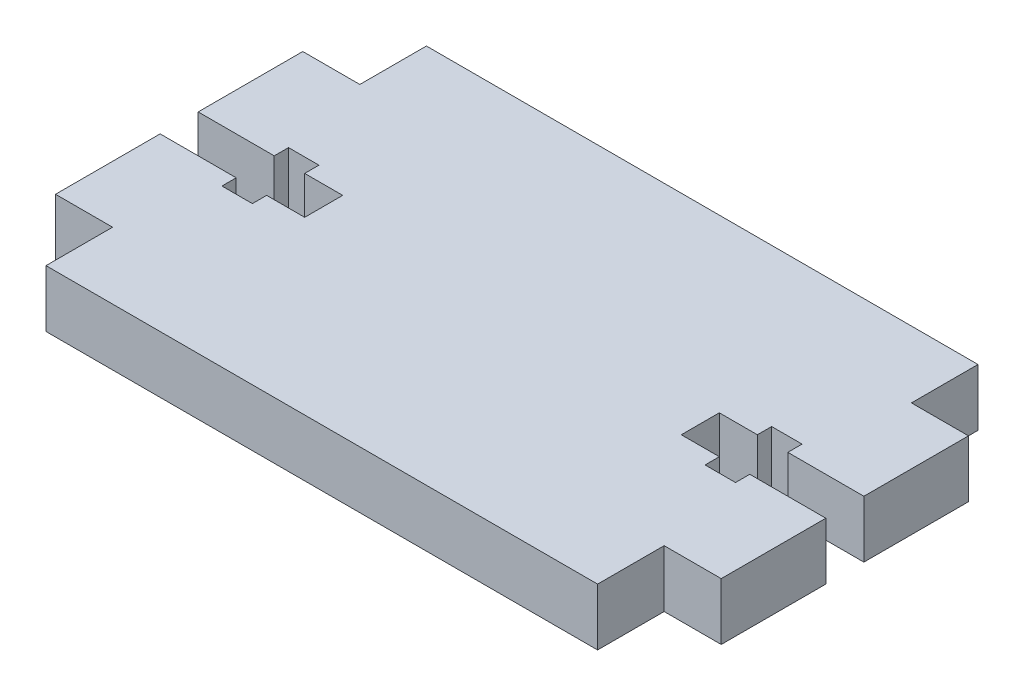
ISO-10303-21;
HEADER;
FILE_DESCRIPTION(('STEP AP214'),'2;1');
FILE_NAME('part.step','',(''),(''),'','','');
FILE_SCHEMA(('AUTOMOTIVE_DESIGN { 1 0 10303 214 1 1 1 1 }'));
ENDSEC;
DATA;
#1=APPLICATION_CONTEXT('core data for automotive mechanical design processes');
#2=APPLICATION_PROTOCOL_DEFINITION('international standard','automotive_design',2000,#1);
#3=PRODUCT_CONTEXT('',#1,'mechanical');
#4=PRODUCT('Part','Part','',(#3));
#5=PRODUCT_RELATED_PRODUCT_CATEGORY('part','',(#4));
#6=PRODUCT_DEFINITION_FORMATION('','',#4);
#7=PRODUCT_DEFINITION_CONTEXT('part definition',#1,'design');
#8=PRODUCT_DEFINITION('design','',#6,#7);
#9=PRODUCT_DEFINITION_SHAPE('','',#8);
#10=(LENGTH_UNIT() NAMED_UNIT(*) SI_UNIT(.MILLI.,.METRE.));
#11=(NAMED_UNIT(*) PLANE_ANGLE_UNIT() SI_UNIT($,.RADIAN.));
#12=(NAMED_UNIT(*) SI_UNIT($,.STERADIAN.) SOLID_ANGLE_UNIT());
#13=UNCERTAINTY_MEASURE_WITH_UNIT(LENGTH_MEASURE(1.E-05),#10,'distance_accuracy_value','');
#14=(GEOMETRIC_REPRESENTATION_CONTEXT(3) GLOBAL_UNCERTAINTY_ASSIGNED_CONTEXT((#13)) GLOBAL_UNIT_ASSIGNED_CONTEXT((#10,
#11,#12)) REPRESENTATION_CONTEXT('',''));
#15=CARTESIAN_POINT('',(0.,0.,0.));
#16=DIRECTION('',(0.,0.,1.));
#17=DIRECTION('',(1.,0.,0.));
#18=AXIS2_PLACEMENT_3D('',#15,#16,#17);
#19=CARTESIAN_POINT('',(29.,6.,13.));
#20=DIRECTION('',(-1.,0.,0.));
#21=DIRECTION('',(0.,0.,1.));
#22=AXIS2_PLACEMENT_3D('',#19,#20,#21);
#23=PLANE('',#22);
#24=DIRECTION('',(0.,0.,-1.));
#25=VECTOR('',#24,1.);
#26=CARTESIAN_POINT('',(29.,0.,13.));
#27=LINE('',#26,#25);
#28=CARTESIAN_POINT('',(29.,0.,20.));
#29=VERTEX_POINT('',#28);
#30=CARTESIAN_POINT('',(29.,0.,13.));
#31=VERTEX_POINT('',#30);
#32=EDGE_CURVE('E305',#29,#31,#27,.T.);
#33=ORIENTED_EDGE('',*,*,#32,.T.);
#34=DIRECTION('',(0.,-1.,0.));
#35=VECTOR('',#34,1.);
#36=CARTESIAN_POINT('',(29.,6.,13.));
#37=LINE('',#36,#35);
#38=CARTESIAN_POINT('',(29.,6.,13.));
#39=VERTEX_POINT('',#38);
#40=EDGE_CURVE('E11',#39,#31,#37,.T.);
#41=ORIENTED_EDGE('',*,*,#40,.F.);
#42=DIRECTION('',(0.,0.,-1.));
#43=VECTOR('',#42,1.);
#44=CARTESIAN_POINT('',(29.,6.,13.));
#45=LINE('',#44,#43);
#46=CARTESIAN_POINT('',(29.,6.,20.));
#47=VERTEX_POINT('',#46);
#48=EDGE_CURVE('E375',#47,#39,#45,.T.);
#49=ORIENTED_EDGE('',*,*,#48,.F.);
#50=DIRECTION('',(0.,-1.,0.));
#51=VECTOR('',#50,1.);
#52=CARTESIAN_POINT('',(29.,6.,20.));
#53=LINE('',#52,#51);
#54=EDGE_CURVE('E301',#47,#29,#53,.T.);
#55=ORIENTED_EDGE('',*,*,#54,.T.);
#56=EDGE_LOOP('',(#33,#41,#49,#55));
#57=FACE_BOUND('',#56,.T.);
#58=ADVANCED_FACE('F41',(#57),#23,.F.);
#59=CARTESIAN_POINT('',(29.,6.,13.));
#60=DIRECTION('',(0.,0.,-1.));
#61=DIRECTION('',(-1.,0.,0.));
#62=AXIS2_PLACEMENT_3D('',#59,#60,#61);
#63=PLANE('',#62);
#64=DIRECTION('',(1.,0.,0.));
#65=VECTOR('',#64,1.);
#66=CARTESIAN_POINT('',(29.,0.,13.));
#67=LINE('',#66,#65);
#68=CARTESIAN_POINT('',(35.,0.,13.));
#69=VERTEX_POINT('',#68);
#70=EDGE_CURVE('E308',#31,#69,#67,.T.);
#71=ORIENTED_EDGE('',*,*,#70,.T.);
#72=DIRECTION('',(0.,-1.,0.));
#73=VECTOR('',#72,1.);
#74=CARTESIAN_POINT('',(35.,6.,13.));
#75=LINE('',#74,#73);
#76=CARTESIAN_POINT('',(35.,6.,13.));
#77=VERTEX_POINT('',#76);
#78=EDGE_CURVE('E49',#77,#69,#75,.T.);
#79=ORIENTED_EDGE('',*,*,#78,.F.);
#80=DIRECTION('',(1.,0.,0.));
#81=VECTOR('',#80,1.);
#82=CARTESIAN_POINT('',(29.,6.,13.));
#83=LINE('',#82,#81);
#84=EDGE_CURVE('E184',#39,#77,#83,.T.);
#85=ORIENTED_EDGE('',*,*,#84,.F.);
#86=ORIENTED_EDGE('',*,*,#40,.T.);
#87=EDGE_LOOP('',(#71,#79,#85,#86));
#88=FACE_BOUND('',#87,.T.);
#89=ADVANCED_FACE('F573',(#88),#63,.F.);
#90=CARTESIAN_POINT('',(35.,6.,13.));
#91=DIRECTION('',(-1.,0.,0.));
#92=DIRECTION('',(0.,0.,1.));
#93=AXIS2_PLACEMENT_3D('',#90,#91,#92);
#94=PLANE('',#93);
#95=DIRECTION('',(0.,0.,-1.));
#96=VECTOR('',#95,1.);
#97=CARTESIAN_POINT('',(35.,0.,13.));
#98=LINE('',#97,#96);
#99=CARTESIAN_POINT('',(35.,0.,2.));
#100=VERTEX_POINT('',#99);
#101=EDGE_CURVE('E310',#69,#100,#98,.T.);
#102=ORIENTED_EDGE('',*,*,#101,.T.);
#103=DIRECTION('',(0.,-1.,0.));
#104=VECTOR('',#103,1.);
#105=CARTESIAN_POINT('',(35.,6.,2.));
#106=LINE('',#105,#104);
#107=CARTESIAN_POINT('',(35.,6.,2.));
#108=VERTEX_POINT('',#107);
#109=EDGE_CURVE('E466',#108,#100,#106,.T.);
#110=ORIENTED_EDGE('',*,*,#109,.F.);
#111=DIRECTION('',(0.,0.,-1.));
#112=VECTOR('',#111,1.);
#113=CARTESIAN_POINT('',(35.,6.,13.));
#114=LINE('',#113,#112);
#115=EDGE_CURVE('E474',#77,#108,#114,.T.);
#116=ORIENTED_EDGE('',*,*,#115,.F.);
#117=ORIENTED_EDGE('',*,*,#78,.T.);
#118=EDGE_LOOP('',(#102,#110,#116,#117));
#119=FACE_BOUND('',#118,.T.);
#120=ADVANCED_FACE('F472',(#119),#94,.F.);
#121=CARTESIAN_POINT('',(26.9999999999999,6.,2.));
#122=DIRECTION('',(0.,0.,1.));
#123=DIRECTION('',(1.,0.,0.));
#124=AXIS2_PLACEMENT_3D('',#121,#122,#123);
#125=PLANE('',#124);
#126=DIRECTION('',(-1.,0.,0.));
#127=VECTOR('',#126,1.);
#128=CARTESIAN_POINT('',(26.9999999999999,0.,2.));
#129=LINE('',#128,#127);
#130=CARTESIAN_POINT('',(26.9999999999999,0.,2.));
#131=VERTEX_POINT('',#130);
#132=EDGE_CURVE('E312',#100,#131,#129,.T.);
#133=ORIENTED_EDGE('',*,*,#132,.T.);
#134=DIRECTION('',(0.,-1.,0.));
#135=VECTOR('',#134,1.);
#136=CARTESIAN_POINT('',(26.9999999999999,6.,2.));
#137=LINE('',#136,#135);
#138=CARTESIAN_POINT('',(26.9999999999999,6.,2.));
#139=VERTEX_POINT('',#138);
#140=EDGE_CURVE('E463',#139,#131,#137,.T.);
#141=ORIENTED_EDGE('',*,*,#140,.F.);
#142=DIRECTION('',(-1.,0.,0.));
#143=VECTOR('',#142,1.);
#144=CARTESIAN_POINT('',(26.9999999999999,6.,2.));
#145=LINE('',#144,#143);
#146=EDGE_CURVE('E492',#108,#139,#145,.T.);
#147=ORIENTED_EDGE('',*,*,#146,.F.);
#148=ORIENTED_EDGE('',*,*,#109,.T.);
#149=EDGE_LOOP('',(#133,#141,#147,#148));
#150=FACE_BOUND('',#149,.T.);
#151=ADVANCED_FACE('F483',(#150),#125,.F.);
#152=CARTESIAN_POINT('',(26.9999999999999,6.,3.5));
#153=DIRECTION('',(1.,0.,0.));
#154=DIRECTION('',(0.,0.,-1.));
#155=AXIS2_PLACEMENT_3D('',#152,#153,#154);
#156=PLANE('',#155);
#157=DIRECTION('',(0.,0.,1.));
#158=VECTOR('',#157,1.);
#159=CARTESIAN_POINT('',(26.9999999999999,0.,3.5));
#160=LINE('',#159,#158);
#161=CARTESIAN_POINT('',(26.9999999999999,0.,3.5));
#162=VERTEX_POINT('',#161);
#163=EDGE_CURVE('E314',#131,#162,#160,.T.);
#164=ORIENTED_EDGE('',*,*,#163,.T.);
#165=DIRECTION('',(0.,-1.,0.));
#166=VECTOR('',#165,1.);
#167=CARTESIAN_POINT('',(26.9999999999999,6.,3.5));
#168=LINE('',#167,#166);
#169=CARTESIAN_POINT('',(26.9999999999999,6.,3.5));
#170=VERTEX_POINT('',#169);
#171=EDGE_CURVE('E460',#170,#162,#168,.T.);
#172=ORIENTED_EDGE('',*,*,#171,.F.);
#173=DIRECTION('',(0.,0.,1.));
#174=VECTOR('',#173,1.);
#175=CARTESIAN_POINT('',(26.9999999999999,6.,3.5));
#176=LINE('',#175,#174);
#177=EDGE_CURVE('E489',#139,#170,#176,.T.);
#178=ORIENTED_EDGE('',*,*,#177,.F.);
#179=ORIENTED_EDGE('',*,*,#140,.T.);
#180=EDGE_LOOP('',(#164,#172,#178,#179));
#181=FACE_BOUND('',#180,.T.);
#182=ADVANCED_FACE('F487',(#181),#156,.F.);
#183=CARTESIAN_POINT('',(23.7999999999999,6.,3.5));
#184=DIRECTION('',(0.,0.,1.));
#185=DIRECTION('',(1.,0.,0.));
#186=AXIS2_PLACEMENT_3D('',#183,#184,#185);
#187=PLANE('',#186);
#188=DIRECTION('',(-1.,0.,0.));
#189=VECTOR('',#188,1.);
#190=CARTESIAN_POINT('',(23.7999999999999,0.,3.5));
#191=LINE('',#190,#189);
#192=CARTESIAN_POINT('',(23.7999999999999,0.,3.5));
#193=VERTEX_POINT('',#192);
#194=EDGE_CURVE('E316',#162,#193,#191,.T.);
#195=ORIENTED_EDGE('',*,*,#194,.T.);
#196=DIRECTION('',(0.,-1.,0.));
#197=VECTOR('',#196,1.);
#198=CARTESIAN_POINT('',(23.7999999999999,6.,3.5));
#199=LINE('',#198,#197);
#200=CARTESIAN_POINT('',(23.7999999999999,6.,3.5));
#201=VERTEX_POINT('',#200);
#202=EDGE_CURVE('E457',#201,#193,#199,.T.);
#203=ORIENTED_EDGE('',*,*,#202,.F.);
#204=DIRECTION('',(-1.,0.,0.));
#205=VECTOR('',#204,1.);
#206=CARTESIAN_POINT('',(23.7999999999999,6.,3.5));
#207=LINE('',#206,#205);
#208=EDGE_CURVE('E491',#170,#201,#207,.T.);
#209=ORIENTED_EDGE('',*,*,#208,.F.);
#210=ORIENTED_EDGE('',*,*,#171,.T.);
#211=EDGE_LOOP('',(#195,#203,#209,#210));
#212=FACE_BOUND('',#211,.T.);
#213=ADVANCED_FACE('F586',(#212),#187,.F.);
#214=CARTESIAN_POINT('',(23.7999999999999,6.,2.));
#215=DIRECTION('',(-1.,0.,0.));
#216=DIRECTION('',(0.,0.,1.));
#217=AXIS2_PLACEMENT_3D('',#214,#215,#216);
#218=PLANE('',#217);
#219=DIRECTION('',(0.,0.,-1.));
#220=VECTOR('',#219,1.);
#221=CARTESIAN_POINT('',(23.7999999999999,0.,2.));
#222=LINE('',#221,#220);
#223=CARTESIAN_POINT('',(23.7999999999999,0.,2.));
#224=VERTEX_POINT('',#223);
#225=EDGE_CURVE('E318',#193,#224,#222,.T.);
#226=ORIENTED_EDGE('',*,*,#225,.T.);
#227=DIRECTION('',(0.,-1.,0.));
#228=VECTOR('',#227,1.);
#229=CARTESIAN_POINT('',(23.7999999999999,6.,2.));
#230=LINE('',#229,#228);
#231=CARTESIAN_POINT('',(23.7999999999999,6.,2.));
#232=VERTEX_POINT('',#231);
#233=EDGE_CURVE('E454',#232,#224,#230,.T.);
#234=ORIENTED_EDGE('',*,*,#233,.F.);
#235=DIRECTION('',(0.,0.,-1.));
#236=VECTOR('',#235,1.);
#237=CARTESIAN_POINT('',(23.7999999999999,6.,2.));
#238=LINE('',#237,#236);
#239=EDGE_CURVE('E494',#201,#232,#238,.T.);
#240=ORIENTED_EDGE('',*,*,#239,.F.);
#241=ORIENTED_EDGE('',*,*,#202,.T.);
#242=EDGE_LOOP('',(#226,#234,#240,#241));
#243=FACE_BOUND('',#242,.T.);
#244=ADVANCED_FACE('F589',(#243),#218,.F.);
#245=CARTESIAN_POINT('',(19.7999999999999,6.,2.00000000000001));
#246=DIRECTION('',(0.,0.,1.));
#247=DIRECTION('',(1.,0.,0.));
#248=AXIS2_PLACEMENT_3D('',#245,#246,#247);
#249=PLANE('',#248);
#250=DIRECTION('',(-1.,0.,0.));
#251=VECTOR('',#250,1.);
#252=CARTESIAN_POINT('',(19.7999999999999,0.,2.00000000000001));
#253=LINE('',#252,#251);
#254=CARTESIAN_POINT('',(19.7999999999999,0.,2.00000000000001));
#255=VERTEX_POINT('',#254);
#256=EDGE_CURVE('E320',#224,#255,#253,.T.);
#257=ORIENTED_EDGE('',*,*,#256,.T.);
#258=DIRECTION('',(0.,-1.,0.));
#259=VECTOR('',#258,1.);
#260=CARTESIAN_POINT('',(19.7999999999999,6.,2.00000000000001));
#261=LINE('',#260,#259);
#262=CARTESIAN_POINT('',(19.7999999999999,6.,2.00000000000001));
#263=VERTEX_POINT('',#262);
#264=EDGE_CURVE('E451',#263,#255,#261,.T.);
#265=ORIENTED_EDGE('',*,*,#264,.F.);
#266=DIRECTION('',(-1.,0.,0.));
#267=VECTOR('',#266,1.);
#268=CARTESIAN_POINT('',(19.7999999999999,6.,2.00000000000001));
#269=LINE('',#268,#267);
#270=EDGE_CURVE('E500',#232,#263,#269,.T.);
#271=ORIENTED_EDGE('',*,*,#270,.F.);
#272=ORIENTED_EDGE('',*,*,#233,.T.);
#273=EDGE_LOOP('',(#257,#265,#271,#272));
#274=FACE_BOUND('',#273,.T.);
#275=ADVANCED_FACE('F593',(#274),#249,.F.);
#276=CARTESIAN_POINT('',(19.7999999999999,6.,-1.99999999999999));
#277=DIRECTION('',(-1.,0.,0.));
#278=DIRECTION('',(0.,0.,1.));
#279=AXIS2_PLACEMENT_3D('',#276,#277,#278);
#280=PLANE('',#279);
#281=DIRECTION('',(0.,0.,-1.));
#282=VECTOR('',#281,1.);
#283=CARTESIAN_POINT('',(19.7999999999999,0.,-1.99999999999999));
#284=LINE('',#283,#282);
#285=CARTESIAN_POINT('',(19.7999999999999,0.,-1.99999999999999));
#286=VERTEX_POINT('',#285);
#287=EDGE_CURVE('E322',#255,#286,#284,.T.);
#288=ORIENTED_EDGE('',*,*,#287,.T.);
#289=DIRECTION('',(0.,-1.,0.));
#290=VECTOR('',#289,1.);
#291=CARTESIAN_POINT('',(19.7999999999999,6.,-1.99999999999999));
#292=LINE('',#291,#290);
#293=CARTESIAN_POINT('',(19.7999999999999,6.,-1.99999999999999));
#294=VERTEX_POINT('',#293);
#295=EDGE_CURVE('E448',#294,#286,#292,.T.);
#296=ORIENTED_EDGE('',*,*,#295,.F.);
#297=DIRECTION('',(0.,0.,-1.));
#298=VECTOR('',#297,1.);
#299=CARTESIAN_POINT('',(19.7999999999999,6.,-1.99999999999999));
#300=LINE('',#299,#298);
#301=EDGE_CURVE('E502',#263,#294,#300,.T.);
#302=ORIENTED_EDGE('',*,*,#301,.F.);
#303=ORIENTED_EDGE('',*,*,#264,.T.);
#304=EDGE_LOOP('',(#288,#296,#302,#303));
#305=FACE_BOUND('',#304,.T.);
#306=ADVANCED_FACE('F597',(#305),#280,.F.);
#307=CARTESIAN_POINT('',(23.7999999999999,6.,-2.));
#308=DIRECTION('',(0.,0.,-1.));
#309=DIRECTION('',(-1.,0.,0.));
#310=AXIS2_PLACEMENT_3D('',#307,#308,#309);
#311=PLANE('',#310);
#312=DIRECTION('',(1.,0.,0.));
#313=VECTOR('',#312,1.);
#314=CARTESIAN_POINT('',(23.7999999999999,0.,-2.));
#315=LINE('',#314,#313);
#316=CARTESIAN_POINT('',(23.7999999999999,0.,-2.));
#317=VERTEX_POINT('',#316);
#318=EDGE_CURVE('E324',#286,#317,#315,.T.);
#319=ORIENTED_EDGE('',*,*,#318,.T.);
#320=DIRECTION('',(0.,-1.,0.));
#321=VECTOR('',#320,1.);
#322=CARTESIAN_POINT('',(23.7999999999999,6.,-2.));
#323=LINE('',#322,#321);
#324=CARTESIAN_POINT('',(23.7999999999999,6.,-2.));
#325=VERTEX_POINT('',#324);
#326=EDGE_CURVE('E445',#325,#317,#323,.T.);
#327=ORIENTED_EDGE('',*,*,#326,.F.);
#328=DIRECTION('',(1.,0.,0.));
#329=VECTOR('',#328,1.);
#330=CARTESIAN_POINT('',(23.7999999999999,6.,-2.));
#331=LINE('',#330,#329);
#332=EDGE_CURVE('E504',#294,#325,#331,.T.);
#333=ORIENTED_EDGE('',*,*,#332,.F.);
#334=ORIENTED_EDGE('',*,*,#295,.T.);
#335=EDGE_LOOP('',(#319,#327,#333,#334));
#336=FACE_BOUND('',#335,.T.);
#337=ADVANCED_FACE('F601',(#336),#311,.F.);
#338=CARTESIAN_POINT('',(23.7999999999999,6.,-3.5));
#339=DIRECTION('',(-1.,0.,0.));
#340=DIRECTION('',(0.,0.,1.));
#341=AXIS2_PLACEMENT_3D('',#338,#339,#340);
#342=PLANE('',#341);
#343=DIRECTION('',(0.,0.,-1.));
#344=VECTOR('',#343,1.);
#345=CARTESIAN_POINT('',(23.7999999999999,0.,-3.5));
#346=LINE('',#345,#344);
#347=CARTESIAN_POINT('',(23.7999999999999,0.,-3.5));
#348=VERTEX_POINT('',#347);
#349=EDGE_CURVE('E326',#317,#348,#346,.T.);
#350=ORIENTED_EDGE('',*,*,#349,.T.);
#351=DIRECTION('',(0.,-1.,0.));
#352=VECTOR('',#351,1.);
#353=CARTESIAN_POINT('',(23.7999999999999,6.,-3.5));
#354=LINE('',#353,#352);
#355=CARTESIAN_POINT('',(23.7999999999999,6.,-3.5));
#356=VERTEX_POINT('',#355);
#357=EDGE_CURVE('E442',#356,#348,#354,.T.);
#358=ORIENTED_EDGE('',*,*,#357,.F.);
#359=DIRECTION('',(0.,0.,-1.));
#360=VECTOR('',#359,1.);
#361=CARTESIAN_POINT('',(23.7999999999999,6.,-3.5));
#362=LINE('',#361,#360);
#363=EDGE_CURVE('E506',#325,#356,#362,.T.);
#364=ORIENTED_EDGE('',*,*,#363,.F.);
#365=ORIENTED_EDGE('',*,*,#326,.T.);
#366=EDGE_LOOP('',(#350,#358,#364,#365));
#367=FACE_BOUND('',#366,.T.);
#368=ADVANCED_FACE('F605',(#367),#342,.F.);
#369=CARTESIAN_POINT('',(26.9999999999999,6.,-3.5));
#370=DIRECTION('',(0.,0.,-1.));
#371=DIRECTION('',(-1.,0.,0.));
#372=AXIS2_PLACEMENT_3D('',#369,#370,#371);
#373=PLANE('',#372);
#374=DIRECTION('',(1.,0.,0.));
#375=VECTOR('',#374,1.);
#376=CARTESIAN_POINT('',(26.9999999999999,0.,-3.5));
#377=LINE('',#376,#375);
#378=CARTESIAN_POINT('',(26.9999999999999,0.,-3.5));
#379=VERTEX_POINT('',#378);
#380=EDGE_CURVE('E328',#348,#379,#377,.T.);
#381=ORIENTED_EDGE('',*,*,#380,.T.);
#382=DIRECTION('',(0.,-1.,0.));
#383=VECTOR('',#382,1.);
#384=CARTESIAN_POINT('',(26.9999999999999,6.,-3.5));
#385=LINE('',#384,#383);
#386=CARTESIAN_POINT('',(26.9999999999999,6.,-3.5));
#387=VERTEX_POINT('',#386);
#388=EDGE_CURVE('E439',#387,#379,#385,.T.);
#389=ORIENTED_EDGE('',*,*,#388,.F.);
#390=DIRECTION('',(1.,0.,0.));
#391=VECTOR('',#390,1.);
#392=CARTESIAN_POINT('',(26.9999999999999,6.,-3.5));
#393=LINE('',#392,#391);
#394=EDGE_CURVE('E508',#356,#387,#393,.T.);
#395=ORIENTED_EDGE('',*,*,#394,.F.);
#396=ORIENTED_EDGE('',*,*,#357,.T.);
#397=EDGE_LOOP('',(#381,#389,#395,#396));
#398=FACE_BOUND('',#397,.T.);
#399=ADVANCED_FACE('F609',(#398),#373,.F.);
#400=CARTESIAN_POINT('',(26.9999999999999,6.,-2.));
#401=DIRECTION('',(1.,0.,0.));
#402=DIRECTION('',(0.,0.,-1.));
#403=AXIS2_PLACEMENT_3D('',#400,#401,#402);
#404=PLANE('',#403);
#405=DIRECTION('',(0.,0.,1.));
#406=VECTOR('',#405,1.);
#407=CARTESIAN_POINT('',(26.9999999999999,0.,-2.));
#408=LINE('',#407,#406);
#409=CARTESIAN_POINT('',(26.9999999999999,0.,-2.));
#410=VERTEX_POINT('',#409);
#411=EDGE_CURVE('E330',#379,#410,#408,.T.);
#412=ORIENTED_EDGE('',*,*,#411,.T.);
#413=DIRECTION('',(0.,-1.,0.));
#414=VECTOR('',#413,1.);
#415=CARTESIAN_POINT('',(26.9999999999999,6.,-2.));
#416=LINE('',#415,#414);
#417=CARTESIAN_POINT('',(26.9999999999999,6.,-2.));
#418=VERTEX_POINT('',#417);
#419=EDGE_CURVE('E436',#418,#410,#416,.T.);
#420=ORIENTED_EDGE('',*,*,#419,.F.);
#421=DIRECTION('',(0.,0.,1.));
#422=VECTOR('',#421,1.);
#423=CARTESIAN_POINT('',(26.9999999999999,6.,-2.));
#424=LINE('',#423,#422);
#425=EDGE_CURVE('E510',#387,#418,#424,.T.);
#426=ORIENTED_EDGE('',*,*,#425,.F.);
#427=ORIENTED_EDGE('',*,*,#388,.T.);
#428=EDGE_LOOP('',(#412,#420,#426,#427));
#429=FACE_BOUND('',#428,.T.);
#430=ADVANCED_FACE('F613',(#429),#404,.F.);
#431=CARTESIAN_POINT('',(34.9999999999999,6.,-1.99999999999999));
#432=DIRECTION('',(0.,0.,-1.));
#433=DIRECTION('',(-1.,0.,0.));
#434=AXIS2_PLACEMENT_3D('',#431,#432,#433);
#435=PLANE('',#434);
#436=DIRECTION('',(1.,0.,0.));
#437=VECTOR('',#436,1.);
#438=CARTESIAN_POINT('',(34.9999999999999,0.,-1.99999999999999));
#439=LINE('',#438,#437);
#440=CARTESIAN_POINT('',(34.9999999999999,0.,-1.99999999999999));
#441=VERTEX_POINT('',#440);
#442=EDGE_CURVE('E332',#410,#441,#439,.T.);
#443=ORIENTED_EDGE('',*,*,#442,.T.);
#444=DIRECTION('',(0.,-1.,0.));
#445=VECTOR('',#444,1.);
#446=CARTESIAN_POINT('',(34.9999999999999,6.,-1.99999999999999));
#447=LINE('',#446,#445);
#448=CARTESIAN_POINT('',(34.9999999999999,6.,-1.99999999999999));
#449=VERTEX_POINT('',#448);
#450=EDGE_CURVE('E433',#449,#441,#447,.T.);
#451=ORIENTED_EDGE('',*,*,#450,.F.);
#452=DIRECTION('',(1.,0.,0.));
#453=VECTOR('',#452,1.);
#454=CARTESIAN_POINT('',(34.9999999999999,6.,-1.99999999999999));
#455=LINE('',#454,#453);
#456=EDGE_CURVE('E512',#418,#449,#455,.T.);
#457=ORIENTED_EDGE('',*,*,#456,.F.);
#458=ORIENTED_EDGE('',*,*,#419,.T.);
#459=EDGE_LOOP('',(#443,#451,#457,#458));
#460=FACE_BOUND('',#459,.T.);
#461=ADVANCED_FACE('F617',(#460),#435,.F.);
#462=CARTESIAN_POINT('',(34.9999999999999,6.,-1.99999999999999));
#463=DIRECTION('',(-1.,0.,0.));
#464=DIRECTION('',(0.,0.,1.));
#465=AXIS2_PLACEMENT_3D('',#462,#463,#464);
#466=PLANE('',#465);
#467=DIRECTION('',(0.,0.,-1.));
#468=VECTOR('',#467,1.);
#469=CARTESIAN_POINT('',(34.9999999999999,0.,-1.99999999999999));
#470=LINE('',#469,#468);
#471=CARTESIAN_POINT('',(35.,0.,-13.));
#472=VERTEX_POINT('',#471);
#473=EDGE_CURVE('E334',#441,#472,#470,.T.);
#474=ORIENTED_EDGE('',*,*,#473,.T.);
#475=DIRECTION('',(0.,-1.,0.));
#476=VECTOR('',#475,1.);
#477=CARTESIAN_POINT('',(35.,6.,-13.));
#478=LINE('',#477,#476);
#479=CARTESIAN_POINT('',(35.,6.,-13.));
#480=VERTEX_POINT('',#479);
#481=EDGE_CURVE('E430',#480,#472,#478,.T.);
#482=ORIENTED_EDGE('',*,*,#481,.F.);
#483=DIRECTION('',(0.,0.,-1.));
#484=VECTOR('',#483,1.);
#485=CARTESIAN_POINT('',(34.9999999999999,6.,-1.99999999999999));
#486=LINE('',#485,#484);
#487=EDGE_CURVE('E514',#449,#480,#486,.T.);
#488=ORIENTED_EDGE('',*,*,#487,.F.);
#489=ORIENTED_EDGE('',*,*,#450,.T.);
#490=EDGE_LOOP('',(#474,#482,#488,#489));
#491=FACE_BOUND('',#490,.T.);
#492=ADVANCED_FACE('F621',(#491),#466,.F.);
#493=CARTESIAN_POINT('',(35.,6.,-13.));
#494=DIRECTION('',(0.,0.,1.));
#495=DIRECTION('',(1.,0.,0.));
#496=AXIS2_PLACEMENT_3D('',#493,#494,#495);
#497=PLANE('',#496);
#498=DIRECTION('',(-1.,0.,0.));
#499=VECTOR('',#498,1.);
#500=CARTESIAN_POINT('',(35.,0.,-13.));
#501=LINE('',#500,#499);
#502=CARTESIAN_POINT('',(29.,0.,-13.));
#503=VERTEX_POINT('',#502);
#504=EDGE_CURVE('E336',#472,#503,#501,.T.);
#505=ORIENTED_EDGE('',*,*,#504,.T.);
#506=DIRECTION('',(0.,-1.,0.));
#507=VECTOR('',#506,1.);
#508=CARTESIAN_POINT('',(29.,6.,-13.));
#509=LINE('',#508,#507);
#510=CARTESIAN_POINT('',(29.,6.,-13.));
#511=VERTEX_POINT('',#510);
#512=EDGE_CURVE('E427',#511,#503,#509,.T.);
#513=ORIENTED_EDGE('',*,*,#512,.F.);
#514=DIRECTION('',(-1.,0.,0.));
#515=VECTOR('',#514,1.);
#516=CARTESIAN_POINT('',(35.,6.,-13.));
#517=LINE('',#516,#515);
#518=EDGE_CURVE('E516',#480,#511,#517,.T.);
#519=ORIENTED_EDGE('',*,*,#518,.F.);
#520=ORIENTED_EDGE('',*,*,#481,.T.);
#521=EDGE_LOOP('',(#505,#513,#519,#520));
#522=FACE_BOUND('',#521,.T.);
#523=ADVANCED_FACE('F625',(#522),#497,.F.);
#524=CARTESIAN_POINT('',(29.,6.,-20.));
#525=DIRECTION('',(-1.,0.,0.));
#526=DIRECTION('',(0.,0.,1.));
#527=AXIS2_PLACEMENT_3D('',#524,#525,#526);
#528=PLANE('',#527);
#529=DIRECTION('',(0.,0.,-1.));
#530=VECTOR('',#529,1.);
#531=CARTESIAN_POINT('',(29.,0.,-20.));
#532=LINE('',#531,#530);
#533=CARTESIAN_POINT('',(29.,0.,-20.));
#534=VERTEX_POINT('',#533);
#535=EDGE_CURVE('E338',#503,#534,#532,.T.);
#536=ORIENTED_EDGE('',*,*,#535,.T.);
#537=DIRECTION('',(0.,-1.,0.));
#538=VECTOR('',#537,1.);
#539=CARTESIAN_POINT('',(29.,6.,-20.));
#540=LINE('',#539,#538);
#541=CARTESIAN_POINT('',(29.,6.,-20.));
#542=VERTEX_POINT('',#541);
#543=EDGE_CURVE('E424',#542,#534,#540,.T.);
#544=ORIENTED_EDGE('',*,*,#543,.F.);
#545=DIRECTION('',(0.,0.,-1.));
#546=VECTOR('',#545,1.);
#547=CARTESIAN_POINT('',(29.,6.,-20.));
#548=LINE('',#547,#546);
#549=EDGE_CURVE('E518',#511,#542,#548,.T.);
#550=ORIENTED_EDGE('',*,*,#549,.F.);
#551=ORIENTED_EDGE('',*,*,#512,.T.);
#552=EDGE_LOOP('',(#536,#544,#550,#551));
#553=FACE_BOUND('',#552,.T.);
#554=ADVANCED_FACE('F629',(#553),#528,.F.);
#555=CARTESIAN_POINT('',(-29.,6.,-20.));
#556=DIRECTION('',(0.,0.,1.));
#557=DIRECTION('',(1.,0.,0.));
#558=AXIS2_PLACEMENT_3D('',#555,#556,#557);
#559=PLANE('',#558);
#560=DIRECTION('',(-1.,0.,0.));
#561=VECTOR('',#560,1.);
#562=CARTESIAN_POINT('',(-29.,0.,-20.));
#563=LINE('',#562,#561);
#564=CARTESIAN_POINT('',(-29.,0.,-20.));
#565=VERTEX_POINT('',#564);
#566=EDGE_CURVE('E340',#534,#565,#563,.T.);
#567=ORIENTED_EDGE('',*,*,#566,.T.);
#568=DIRECTION('',(0.,-1.,0.));
#569=VECTOR('',#568,1.);
#570=CARTESIAN_POINT('',(-29.,6.,-20.));
#571=LINE('',#570,#569);
#572=CARTESIAN_POINT('',(-29.,6.,-20.));
#573=VERTEX_POINT('',#572);
#574=EDGE_CURVE('E421',#573,#565,#571,.T.);
#575=ORIENTED_EDGE('',*,*,#574,.F.);
#576=DIRECTION('',(-1.,0.,0.));
#577=VECTOR('',#576,1.);
#578=CARTESIAN_POINT('',(-29.,6.,-20.));
#579=LINE('',#578,#577);
#580=EDGE_CURVE('E520',#542,#573,#579,.T.);
#581=ORIENTED_EDGE('',*,*,#580,.F.);
#582=ORIENTED_EDGE('',*,*,#543,.T.);
#583=EDGE_LOOP('',(#567,#575,#581,#582));
#584=FACE_BOUND('',#583,.T.);
#585=ADVANCED_FACE('F633',(#584),#559,.F.);
#586=CARTESIAN_POINT('',(-29.,6.,-20.));
#587=DIRECTION('',(1.,0.,0.));
#588=DIRECTION('',(0.,0.,-1.));
#589=AXIS2_PLACEMENT_3D('',#586,#587,#588);
#590=PLANE('',#589);
#591=DIRECTION('',(0.,0.,1.));
#592=VECTOR('',#591,1.);
#593=CARTESIAN_POINT('',(-29.,0.,-20.));
#594=LINE('',#593,#592);
#595=CARTESIAN_POINT('',(-29.,0.,-13.));
#596=VERTEX_POINT('',#595);
#597=EDGE_CURVE('E342',#565,#596,#594,.T.);
#598=ORIENTED_EDGE('',*,*,#597,.T.);
#599=DIRECTION('',(0.,-1.,0.));
#600=VECTOR('',#599,1.);
#601=CARTESIAN_POINT('',(-29.,6.,-13.));
#602=LINE('',#601,#600);
#603=CARTESIAN_POINT('',(-29.,6.,-13.));
#604=VERTEX_POINT('',#603);
#605=EDGE_CURVE('E418',#604,#596,#602,.T.);
#606=ORIENTED_EDGE('',*,*,#605,.F.);
#607=DIRECTION('',(0.,0.,1.));
#608=VECTOR('',#607,1.);
#609=CARTESIAN_POINT('',(-29.,6.,-20.));
#610=LINE('',#609,#608);
#611=EDGE_CURVE('E522',#573,#604,#610,.T.);
#612=ORIENTED_EDGE('',*,*,#611,.F.);
#613=ORIENTED_EDGE('',*,*,#574,.T.);
#614=EDGE_LOOP('',(#598,#606,#612,#613));
#615=FACE_BOUND('',#614,.T.);
#616=ADVANCED_FACE('F637',(#615),#590,.F.);
#617=CARTESIAN_POINT('',(-35.,6.,-13.));
#618=DIRECTION('',(0.,0.,1.));
#619=DIRECTION('',(1.,0.,0.));
#620=AXIS2_PLACEMENT_3D('',#617,#618,#619);
#621=PLANE('',#620);
#622=DIRECTION('',(-1.,0.,0.));
#623=VECTOR('',#622,1.);
#624=CARTESIAN_POINT('',(-35.,0.,-13.));
#625=LINE('',#624,#623);
#626=CARTESIAN_POINT('',(-35.,0.,-13.));
#627=VERTEX_POINT('',#626);
#628=EDGE_CURVE('E344',#596,#627,#625,.T.);
#629=ORIENTED_EDGE('',*,*,#628,.T.);
#630=DIRECTION('',(0.,-1.,0.));
#631=VECTOR('',#630,1.);
#632=CARTESIAN_POINT('',(-35.,6.,-13.));
#633=LINE('',#632,#631);
#634=CARTESIAN_POINT('',(-35.,6.,-13.));
#635=VERTEX_POINT('',#634);
#636=EDGE_CURVE('E415',#635,#627,#633,.T.);
#637=ORIENTED_EDGE('',*,*,#636,.F.);
#638=DIRECTION('',(-1.,0.,0.));
#639=VECTOR('',#638,1.);
#640=CARTESIAN_POINT('',(-35.,6.,-13.));
#641=LINE('',#640,#639);
#642=EDGE_CURVE('E524',#604,#635,#641,.T.);
#643=ORIENTED_EDGE('',*,*,#642,.F.);
#644=ORIENTED_EDGE('',*,*,#605,.T.);
#645=EDGE_LOOP('',(#629,#637,#643,#644));
#646=FACE_BOUND('',#645,.T.);
#647=ADVANCED_FACE('F641',(#646),#621,.F.);
#648=CARTESIAN_POINT('',(-35.,6.,-1.99999999999998));
#649=DIRECTION('',(1.,0.,0.));
#650=DIRECTION('',(0.,0.,-1.));
#651=AXIS2_PLACEMENT_3D('',#648,#649,#650);
#652=PLANE('',#651);
#653=DIRECTION('',(0.,0.,1.));
#654=VECTOR('',#653,1.);
#655=CARTESIAN_POINT('',(-35.,0.,-1.99999999999998));
#656=LINE('',#655,#654);
#657=CARTESIAN_POINT('',(-35.,0.,-1.99999999999998));
#658=VERTEX_POINT('',#657);
#659=EDGE_CURVE('E346',#627,#658,#656,.T.);
#660=ORIENTED_EDGE('',*,*,#659,.T.);
#661=DIRECTION('',(0.,-1.,0.));
#662=VECTOR('',#661,1.);
#663=CARTESIAN_POINT('',(-35.,6.,-1.99999999999998));
#664=LINE('',#663,#662);
#665=CARTESIAN_POINT('',(-35.,6.,-1.99999999999998));
#666=VERTEX_POINT('',#665);
#667=EDGE_CURVE('E412',#666,#658,#664,.T.);
#668=ORIENTED_EDGE('',*,*,#667,.F.);
#669=DIRECTION('',(0.,0.,1.));
#670=VECTOR('',#669,1.);
#671=CARTESIAN_POINT('',(-35.,6.,-1.99999999999998));
#672=LINE('',#671,#670);
#673=EDGE_CURVE('E526',#635,#666,#672,.T.);
#674=ORIENTED_EDGE('',*,*,#673,.F.);
#675=ORIENTED_EDGE('',*,*,#636,.T.);
#676=EDGE_LOOP('',(#660,#668,#674,#675));
#677=FACE_BOUND('',#676,.T.);
#678=ADVANCED_FACE('F645',(#677),#652,.F.);
#679=CARTESIAN_POINT('',(-35.,6.,-1.99999999999998));
#680=DIRECTION('',(0.,0.,-1.));
#681=DIRECTION('',(-1.,0.,0.));
#682=AXIS2_PLACEMENT_3D('',#679,#680,#681);
#683=PLANE('',#682);
#684=DIRECTION('',(1.,0.,0.));
#685=VECTOR('',#684,1.);
#686=CARTESIAN_POINT('',(-35.,0.,-1.99999999999998));
#687=LINE('',#686,#685);
#688=CARTESIAN_POINT('',(-27.,0.,-1.99999999999999));
#689=VERTEX_POINT('',#688);
#690=EDGE_CURVE('E348',#658,#689,#687,.T.);
#691=ORIENTED_EDGE('',*,*,#690,.T.);
#692=DIRECTION('',(0.,-1.,0.));
#693=VECTOR('',#692,1.);
#694=CARTESIAN_POINT('',(-27.,6.,-1.99999999999999));
#695=LINE('',#694,#693);
#696=CARTESIAN_POINT('',(-27.,6.,-1.99999999999999));
#697=VERTEX_POINT('',#696);
#698=EDGE_CURVE('E409',#697,#689,#695,.T.);
#699=ORIENTED_EDGE('',*,*,#698,.F.);
#700=DIRECTION('',(1.,0.,0.));
#701=VECTOR('',#700,1.);
#702=CARTESIAN_POINT('',(-35.,6.,-1.99999999999998));
#703=LINE('',#702,#701);
#704=EDGE_CURVE('E528',#666,#697,#703,.T.);
#705=ORIENTED_EDGE('',*,*,#704,.F.);
#706=ORIENTED_EDGE('',*,*,#667,.T.);
#707=EDGE_LOOP('',(#691,#699,#705,#706));
#708=FACE_BOUND('',#707,.T.);
#709=ADVANCED_FACE('F649',(#708),#683,.F.);
#710=CARTESIAN_POINT('',(-27.,6.,-1.99999999999999));
#711=DIRECTION('',(-1.,0.,0.));
#712=DIRECTION('',(0.,0.,1.));
#713=AXIS2_PLACEMENT_3D('',#710,#711,#712);
#714=PLANE('',#713);
#715=DIRECTION('',(0.,0.,-1.));
#716=VECTOR('',#715,1.);
#717=CARTESIAN_POINT('',(-27.,0.,-1.99999999999999));
#718=LINE('',#717,#716);
#719=CARTESIAN_POINT('',(-27.,0.,-3.49999999999999));
#720=VERTEX_POINT('',#719);
#721=EDGE_CURVE('E350',#689,#720,#718,.T.);
#722=ORIENTED_EDGE('',*,*,#721,.T.);
#723=DIRECTION('',(0.,-1.,0.));
#724=VECTOR('',#723,1.);
#725=CARTESIAN_POINT('',(-27.,6.,-3.49999999999999));
#726=LINE('',#725,#724);
#727=CARTESIAN_POINT('',(-27.,6.,-3.49999999999999));
#728=VERTEX_POINT('',#727);
#729=EDGE_CURVE('E406',#728,#720,#726,.T.);
#730=ORIENTED_EDGE('',*,*,#729,.F.);
#731=DIRECTION('',(0.,0.,-1.));
#732=VECTOR('',#731,1.);
#733=CARTESIAN_POINT('',(-27.,6.,-1.99999999999999));
#734=LINE('',#733,#732);
#735=EDGE_CURVE('E530',#697,#728,#734,.T.);
#736=ORIENTED_EDGE('',*,*,#735,.F.);
#737=ORIENTED_EDGE('',*,*,#698,.T.);
#738=EDGE_LOOP('',(#722,#730,#736,#737));
#739=FACE_BOUND('',#738,.T.);
#740=ADVANCED_FACE('F653',(#739),#714,.F.);
#741=CARTESIAN_POINT('',(-27.,6.,-3.49999999999999));
#742=DIRECTION('',(0.,0.,-1.));
#743=DIRECTION('',(-1.,0.,0.));
#744=AXIS2_PLACEMENT_3D('',#741,#742,#743);
#745=PLANE('',#744);
#746=DIRECTION('',(1.,0.,0.));
#747=VECTOR('',#746,1.);
#748=CARTESIAN_POINT('',(-27.,0.,-3.49999999999999));
#749=LINE('',#748,#747);
#750=CARTESIAN_POINT('',(-23.8,0.,-3.49999999999999));
#751=VERTEX_POINT('',#750);
#752=EDGE_CURVE('E352',#720,#751,#749,.T.);
#753=ORIENTED_EDGE('',*,*,#752,.T.);
#754=DIRECTION('',(0.,-1.,0.));
#755=VECTOR('',#754,1.);
#756=CARTESIAN_POINT('',(-23.8,6.,-3.49999999999999));
#757=LINE('',#756,#755);
#758=CARTESIAN_POINT('',(-23.8,6.,-3.49999999999999));
#759=VERTEX_POINT('',#758);
#760=EDGE_CURVE('E403',#759,#751,#757,.T.);
#761=ORIENTED_EDGE('',*,*,#760,.F.);
#762=DIRECTION('',(1.,0.,0.));
#763=VECTOR('',#762,1.);
#764=CARTESIAN_POINT('',(-27.,6.,-3.49999999999999));
#765=LINE('',#764,#763);
#766=EDGE_CURVE('E532',#728,#759,#765,.T.);
#767=ORIENTED_EDGE('',*,*,#766,.F.);
#768=ORIENTED_EDGE('',*,*,#729,.T.);
#769=EDGE_LOOP('',(#753,#761,#767,#768));
#770=FACE_BOUND('',#769,.T.);
#771=ADVANCED_FACE('F657',(#770),#745,.F.);
#772=CARTESIAN_POINT('',(-23.8,6.,-3.49999999999999));
#773=DIRECTION('',(1.,0.,0.));
#774=DIRECTION('',(0.,0.,-1.));
#775=AXIS2_PLACEMENT_3D('',#772,#773,#774);
#776=PLANE('',#775);
#777=DIRECTION('',(0.,0.,1.));
#778=VECTOR('',#777,1.);
#779=CARTESIAN_POINT('',(-23.8,0.,-3.49999999999999));
#780=LINE('',#779,#778);
#781=CARTESIAN_POINT('',(-23.8,0.,-1.99999999999999));
#782=VERTEX_POINT('',#781);
#783=EDGE_CURVE('E354',#751,#782,#780,.T.);
#784=ORIENTED_EDGE('',*,*,#783,.T.);
#785=DIRECTION('',(0.,-1.,0.));
#786=VECTOR('',#785,1.);
#787=CARTESIAN_POINT('',(-23.8,6.,-1.99999999999999));
#788=LINE('',#787,#786);
#789=CARTESIAN_POINT('',(-23.8,6.,-1.99999999999999));
#790=VERTEX_POINT('',#789);
#791=EDGE_CURVE('E400',#790,#782,#788,.T.);
#792=ORIENTED_EDGE('',*,*,#791,.F.);
#793=DIRECTION('',(0.,0.,1.));
#794=VECTOR('',#793,1.);
#795=CARTESIAN_POINT('',(-23.8,6.,-3.49999999999999));
#796=LINE('',#795,#794);
#797=EDGE_CURVE('E534',#759,#790,#796,.T.);
#798=ORIENTED_EDGE('',*,*,#797,.F.);
#799=ORIENTED_EDGE('',*,*,#760,.T.);
#800=EDGE_LOOP('',(#784,#792,#798,#799));
#801=FACE_BOUND('',#800,.T.);
#802=ADVANCED_FACE('F661',(#801),#776,.F.);
#803=CARTESIAN_POINT('',(-23.8,6.,-1.99999999999999));
#804=DIRECTION('',(0.,0.,-1.));
#805=DIRECTION('',(-1.,0.,0.));
#806=AXIS2_PLACEMENT_3D('',#803,#804,#805);
#807=PLANE('',#806);
#808=DIRECTION('',(1.,0.,0.));
#809=VECTOR('',#808,1.);
#810=CARTESIAN_POINT('',(-23.8,0.,-1.99999999999999));
#811=LINE('',#810,#809);
#812=CARTESIAN_POINT('',(-19.8,0.,-1.99999999999999));
#813=VERTEX_POINT('',#812);
#814=EDGE_CURVE('E356',#782,#813,#811,.T.);
#815=ORIENTED_EDGE('',*,*,#814,.T.);
#816=DIRECTION('',(0.,-1.,0.));
#817=VECTOR('',#816,1.);
#818=CARTESIAN_POINT('',(-19.8,6.,-1.99999999999999));
#819=LINE('',#818,#817);
#820=CARTESIAN_POINT('',(-19.8,6.,-1.99999999999999));
#821=VERTEX_POINT('',#820);
#822=EDGE_CURVE('E397',#821,#813,#819,.T.);
#823=ORIENTED_EDGE('',*,*,#822,.F.);
#824=DIRECTION('',(1.,0.,0.));
#825=VECTOR('',#824,1.);
#826=CARTESIAN_POINT('',(-23.8,6.,-1.99999999999999));
#827=LINE('',#826,#825);
#828=EDGE_CURVE('E536',#790,#821,#827,.T.);
#829=ORIENTED_EDGE('',*,*,#828,.F.);
#830=ORIENTED_EDGE('',*,*,#791,.T.);
#831=EDGE_LOOP('',(#815,#823,#829,#830));
#832=FACE_BOUND('',#831,.T.);
#833=ADVANCED_FACE('F665',(#832),#807,.F.);
#834=CARTESIAN_POINT('',(-19.8,6.,-1.99999999999999));
#835=DIRECTION('',(1.,0.,0.));
#836=DIRECTION('',(0.,0.,-1.));
#837=AXIS2_PLACEMENT_3D('',#834,#835,#836);
#838=PLANE('',#837);
#839=DIRECTION('',(0.,0.,1.));
#840=VECTOR('',#839,1.);
#841=CARTESIAN_POINT('',(-19.8,0.,-1.99999999999999));
#842=LINE('',#841,#840);
#843=CARTESIAN_POINT('',(-19.8,0.,2.00000000000001));
#844=VERTEX_POINT('',#843);
#845=EDGE_CURVE('E358',#813,#844,#842,.T.);
#846=ORIENTED_EDGE('',*,*,#845,.T.);
#847=DIRECTION('',(0.,-1.,0.));
#848=VECTOR('',#847,1.);
#849=CARTESIAN_POINT('',(-19.8,6.,2.00000000000001));
#850=LINE('',#849,#848);
#851=CARTESIAN_POINT('',(-19.8,6.,2.00000000000001));
#852=VERTEX_POINT('',#851);
#853=EDGE_CURVE('E394',#852,#844,#850,.T.);
#854=ORIENTED_EDGE('',*,*,#853,.F.);
#855=DIRECTION('',(0.,0.,1.));
#856=VECTOR('',#855,1.);
#857=CARTESIAN_POINT('',(-19.8,6.,-1.99999999999999));
#858=LINE('',#857,#856);
#859=EDGE_CURVE('E538',#821,#852,#858,.T.);
#860=ORIENTED_EDGE('',*,*,#859,.F.);
#861=ORIENTED_EDGE('',*,*,#822,.T.);
#862=EDGE_LOOP('',(#846,#854,#860,#861));
#863=FACE_BOUND('',#862,.T.);
#864=ADVANCED_FACE('F669',(#863),#838,.F.);
#865=CARTESIAN_POINT('',(-19.8,6.,2.00000000000001));
#866=DIRECTION('',(0.,0.,1.));
#867=DIRECTION('',(1.,0.,0.));
#868=AXIS2_PLACEMENT_3D('',#865,#866,#867);
#869=PLANE('',#868);
#870=DIRECTION('',(-1.,0.,0.));
#871=VECTOR('',#870,1.);
#872=CARTESIAN_POINT('',(-19.8,0.,2.00000000000001));
#873=LINE('',#872,#871);
#874=CARTESIAN_POINT('',(-23.8,0.,2.00000000000001));
#875=VERTEX_POINT('',#874);
#876=EDGE_CURVE('E360',#844,#875,#873,.T.);
#877=ORIENTED_EDGE('',*,*,#876,.T.);
#878=DIRECTION('',(0.,-1.,0.));
#879=VECTOR('',#878,1.);
#880=CARTESIAN_POINT('',(-23.8,6.,2.00000000000001));
#881=LINE('',#880,#879);
#882=CARTESIAN_POINT('',(-23.8,6.,2.00000000000001));
#883=VERTEX_POINT('',#882);
#884=EDGE_CURVE('E391',#883,#875,#881,.T.);
#885=ORIENTED_EDGE('',*,*,#884,.F.);
#886=DIRECTION('',(-1.,0.,0.));
#887=VECTOR('',#886,1.);
#888=CARTESIAN_POINT('',(-19.8,6.,2.00000000000001));
#889=LINE('',#888,#887);
#890=EDGE_CURVE('E540',#852,#883,#889,.T.);
#891=ORIENTED_EDGE('',*,*,#890,.F.);
#892=ORIENTED_EDGE('',*,*,#853,.T.);
#893=EDGE_LOOP('',(#877,#885,#891,#892));
#894=FACE_BOUND('',#893,.T.);
#895=ADVANCED_FACE('F673',(#894),#869,.F.);
#896=CARTESIAN_POINT('',(-23.8,6.,2.00000000000001));
#897=DIRECTION('',(1.,0.,0.));
#898=DIRECTION('',(0.,0.,-1.));
#899=AXIS2_PLACEMENT_3D('',#896,#897,#898);
#900=PLANE('',#899);
#901=DIRECTION('',(0.,0.,1.));
#902=VECTOR('',#901,1.);
#903=CARTESIAN_POINT('',(-23.8,0.,2.00000000000001));
#904=LINE('',#903,#902);
#905=CARTESIAN_POINT('',(-23.8,0.,3.50000000000001));
#906=VERTEX_POINT('',#905);
#907=EDGE_CURVE('E362',#875,#906,#904,.T.);
#908=ORIENTED_EDGE('',*,*,#907,.T.);
#909=DIRECTION('',(0.,-1.,0.));
#910=VECTOR('',#909,1.);
#911=CARTESIAN_POINT('',(-23.8,6.,3.50000000000001));
#912=LINE('',#911,#910);
#913=CARTESIAN_POINT('',(-23.8,6.,3.50000000000001));
#914=VERTEX_POINT('',#913);
#915=EDGE_CURVE('E388',#914,#906,#912,.T.);
#916=ORIENTED_EDGE('',*,*,#915,.F.);
#917=DIRECTION('',(0.,0.,1.));
#918=VECTOR('',#917,1.);
#919=CARTESIAN_POINT('',(-23.8,6.,2.00000000000001));
#920=LINE('',#919,#918);
#921=EDGE_CURVE('E542',#883,#914,#920,.T.);
#922=ORIENTED_EDGE('',*,*,#921,.F.);
#923=ORIENTED_EDGE('',*,*,#884,.T.);
#924=EDGE_LOOP('',(#908,#916,#922,#923));
#925=FACE_BOUND('',#924,.T.);
#926=ADVANCED_FACE('F677',(#925),#900,.F.);
#927=CARTESIAN_POINT('',(-23.8,6.,3.50000000000001));
#928=DIRECTION('',(0.,0.,1.));
#929=DIRECTION('',(1.,0.,0.));
#930=AXIS2_PLACEMENT_3D('',#927,#928,#929);
#931=PLANE('',#930);
#932=DIRECTION('',(-1.,0.,0.));
#933=VECTOR('',#932,1.);
#934=CARTESIAN_POINT('',(-23.8,0.,3.50000000000001));
#935=LINE('',#934,#933);
#936=CARTESIAN_POINT('',(-27.,0.,3.50000000000001));
#937=VERTEX_POINT('',#936);
#938=EDGE_CURVE('E364',#906,#937,#935,.T.);
#939=ORIENTED_EDGE('',*,*,#938,.T.);
#940=DIRECTION('',(0.,-1.,0.));
#941=VECTOR('',#940,1.);
#942=CARTESIAN_POINT('',(-27.,6.,3.50000000000001));
#943=LINE('',#942,#941);
#944=CARTESIAN_POINT('',(-27.,6.,3.50000000000001));
#945=VERTEX_POINT('',#944);
#946=EDGE_CURVE('E385',#945,#937,#943,.T.);
#947=ORIENTED_EDGE('',*,*,#946,.F.);
#948=DIRECTION('',(-1.,0.,0.));
#949=VECTOR('',#948,1.);
#950=CARTESIAN_POINT('',(-23.8,6.,3.50000000000001));
#951=LINE('',#950,#949);
#952=EDGE_CURVE('E544',#914,#945,#951,.T.);
#953=ORIENTED_EDGE('',*,*,#952,.F.);
#954=ORIENTED_EDGE('',*,*,#915,.T.);
#955=EDGE_LOOP('',(#939,#947,#953,#954));
#956=FACE_BOUND('',#955,.T.);
#957=ADVANCED_FACE('F681',(#956),#931,.F.);
#958=CARTESIAN_POINT('',(-27.,6.,3.50000000000001));
#959=DIRECTION('',(-1.,0.,0.));
#960=DIRECTION('',(0.,0.,1.));
#961=AXIS2_PLACEMENT_3D('',#958,#959,#960);
#962=PLANE('',#961);
#963=DIRECTION('',(0.,0.,-1.));
#964=VECTOR('',#963,1.);
#965=CARTESIAN_POINT('',(-27.,0.,3.50000000000001));
#966=LINE('',#965,#964);
#967=CARTESIAN_POINT('',(-27.,0.,2.00000000000001));
#968=VERTEX_POINT('',#967);
#969=EDGE_CURVE('E366',#937,#968,#966,.T.);
#970=ORIENTED_EDGE('',*,*,#969,.T.);
#971=DIRECTION('',(0.,-1.,0.));
#972=VECTOR('',#971,1.);
#973=CARTESIAN_POINT('',(-27.,6.,2.00000000000001));
#974=LINE('',#973,#972);
#975=CARTESIAN_POINT('',(-27.,6.,2.00000000000001));
#976=VERTEX_POINT('',#975);
#977=EDGE_CURVE('E382',#976,#968,#974,.T.);
#978=ORIENTED_EDGE('',*,*,#977,.F.);
#979=DIRECTION('',(0.,0.,-1.));
#980=VECTOR('',#979,1.);
#981=CARTESIAN_POINT('',(-27.,6.,3.50000000000001));
#982=LINE('',#981,#980);
#983=EDGE_CURVE('E546',#945,#976,#982,.T.);
#984=ORIENTED_EDGE('',*,*,#983,.F.);
#985=ORIENTED_EDGE('',*,*,#946,.T.);
#986=EDGE_LOOP('',(#970,#978,#984,#985));
#987=FACE_BOUND('',#986,.T.);
#988=ADVANCED_FACE('F685',(#987),#962,.F.);
#989=CARTESIAN_POINT('',(-27.,6.,2.00000000000001));
#990=DIRECTION('',(0.,0.,1.));
#991=DIRECTION('',(1.,0.,0.));
#992=AXIS2_PLACEMENT_3D('',#989,#990,#991);
#993=PLANE('',#992);
#994=DIRECTION('',(-1.,0.,0.));
#995=VECTOR('',#994,1.);
#996=CARTESIAN_POINT('',(-27.,0.,2.00000000000001));
#997=LINE('',#996,#995);
#998=CARTESIAN_POINT('',(-35.,0.,2.00000000000001));
#999=VERTEX_POINT('',#998);
#1000=EDGE_CURVE('E368',#968,#999,#997,.T.);
#1001=ORIENTED_EDGE('',*,*,#1000,.T.);
#1002=DIRECTION('',(0.,-1.,0.));
#1003=VECTOR('',#1002,1.);
#1004=CARTESIAN_POINT('',(-35.,6.,2.00000000000001));
#1005=LINE('',#1004,#1003);
#1006=CARTESIAN_POINT('',(-35.,6.,2.00000000000001));
#1007=VERTEX_POINT('',#1006);
#1008=EDGE_CURVE('E379',#1007,#999,#1005,.T.);
#1009=ORIENTED_EDGE('',*,*,#1008,.F.);
#1010=DIRECTION('',(-1.,0.,0.));
#1011=VECTOR('',#1010,1.);
#1012=CARTESIAN_POINT('',(-27.,6.,2.00000000000001));
#1013=LINE('',#1012,#1011);
#1014=EDGE_CURVE('E548',#976,#1007,#1013,.T.);
#1015=ORIENTED_EDGE('',*,*,#1014,.F.);
#1016=ORIENTED_EDGE('',*,*,#977,.T.);
#1017=EDGE_LOOP('',(#1001,#1009,#1015,#1016));
#1018=FACE_BOUND('',#1017,.T.);
#1019=ADVANCED_FACE('F554',(#1018),#993,.F.);
#1020=CARTESIAN_POINT('',(-35.,6.,13.));
#1021=DIRECTION('',(1.,0.,0.));
#1022=DIRECTION('',(0.,0.,-1.));
#1023=AXIS2_PLACEMENT_3D('',#1020,#1021,#1022);
#1024=PLANE('',#1023);
#1025=DIRECTION('',(0.,0.,1.));
#1026=VECTOR('',#1025,1.);
#1027=CARTESIAN_POINT('',(-35.,0.,13.));
#1028=LINE('',#1027,#1026);
#1029=CARTESIAN_POINT('',(-35.,0.,13.));
#1030=VERTEX_POINT('',#1029);
#1031=EDGE_CURVE('E370',#999,#1030,#1028,.T.);
#1032=ORIENTED_EDGE('',*,*,#1031,.T.);
#1033=DIRECTION('',(0.,-1.,0.));
#1034=VECTOR('',#1033,1.);
#1035=CARTESIAN_POINT('',(-35.,6.,13.));
#1036=LINE('',#1035,#1034);
#1037=CARTESIAN_POINT('',(-35.,6.,13.));
#1038=VERTEX_POINT('',#1037);
#1039=EDGE_CURVE('E296',#1038,#1030,#1036,.T.);
#1040=ORIENTED_EDGE('',*,*,#1039,.F.);
#1041=DIRECTION('',(0.,0.,1.));
#1042=VECTOR('',#1041,1.);
#1043=CARTESIAN_POINT('',(-35.,6.,13.));
#1044=LINE('',#1043,#1042);
#1045=EDGE_CURVE('E287',#1007,#1038,#1044,.T.);
#1046=ORIENTED_EDGE('',*,*,#1045,.F.);
#1047=ORIENTED_EDGE('',*,*,#1008,.T.);
#1048=EDGE_LOOP('',(#1032,#1040,#1046,#1047));
#1049=FACE_BOUND('',#1048,.T.);
#1050=ADVANCED_FACE('F558',(#1049),#1024,.F.);
#1051=CARTESIAN_POINT('',(-29.,6.,13.));
#1052=DIRECTION('',(0.,0.,-1.));
#1053=DIRECTION('',(-1.,0.,0.));
#1054=AXIS2_PLACEMENT_3D('',#1051,#1052,#1053);
#1055=PLANE('',#1054);
#1056=DIRECTION('',(1.,0.,0.));
#1057=VECTOR('',#1056,1.);
#1058=CARTESIAN_POINT('',(-29.,0.,13.));
#1059=LINE('',#1058,#1057);
#1060=CARTESIAN_POINT('',(-29.,0.,13.));
#1061=VERTEX_POINT('',#1060);
#1062=EDGE_CURVE('E295',#1030,#1061,#1059,.T.);
#1063=ORIENTED_EDGE('',*,*,#1062,.T.);
#1064=DIRECTION('',(0.,-1.,0.));
#1065=VECTOR('',#1064,1.);
#1066=CARTESIAN_POINT('',(-29.,6.,13.));
#1067=LINE('',#1066,#1065);
#1068=CARTESIAN_POINT('',(-29.,6.,13.));
#1069=VERTEX_POINT('',#1068);
#1070=EDGE_CURVE('E292',#1069,#1061,#1067,.T.);
#1071=ORIENTED_EDGE('',*,*,#1070,.F.);
#1072=DIRECTION('',(1.,0.,0.));
#1073=VECTOR('',#1072,1.);
#1074=CARTESIAN_POINT('',(-29.,6.,13.));
#1075=LINE('',#1074,#1073);
#1076=EDGE_CURVE('E281',#1038,#1069,#1075,.T.);
#1077=ORIENTED_EDGE('',*,*,#1076,.F.);
#1078=ORIENTED_EDGE('',*,*,#1039,.T.);
#1079=EDGE_LOOP('',(#1063,#1071,#1077,#1078));
#1080=FACE_BOUND('',#1079,.T.);
#1081=ADVANCED_FACE('F293',(#1080),#1055,.F.);
#1082=CARTESIAN_POINT('',(-29.,6.,13.));
#1083=DIRECTION('',(1.,0.,0.));
#1084=DIRECTION('',(0.,0.,-1.));
#1085=AXIS2_PLACEMENT_3D('',#1082,#1083,#1084);
#1086=PLANE('',#1085);
#1087=DIRECTION('',(0.,0.,1.));
#1088=VECTOR('',#1087,1.);
#1089=CARTESIAN_POINT('',(-29.,0.,13.));
#1090=LINE('',#1089,#1088);
#1091=CARTESIAN_POINT('',(-29.,0.,20.));
#1092=VERTEX_POINT('',#1091);
#1093=EDGE_CURVE('E170',#1061,#1092,#1090,.T.);
#1094=ORIENTED_EDGE('',*,*,#1093,.T.);
#1095=DIRECTION('',(0.,-1.,0.));
#1096=VECTOR('',#1095,1.);
#1097=CARTESIAN_POINT('',(-29.,6.,20.));
#1098=LINE('',#1097,#1096);
#1099=CARTESIAN_POINT('',(-29.,6.,20.));
#1100=VERTEX_POINT('',#1099);
#1101=EDGE_CURVE('E297',#1100,#1092,#1098,.T.);
#1102=ORIENTED_EDGE('',*,*,#1101,.F.);
#1103=DIRECTION('',(0.,0.,1.));
#1104=VECTOR('',#1103,1.);
#1105=CARTESIAN_POINT('',(-29.,6.,13.));
#1106=LINE('',#1105,#1104);
#1107=EDGE_CURVE('E285',#1069,#1100,#1106,.T.);
#1108=ORIENTED_EDGE('',*,*,#1107,.F.);
#1109=ORIENTED_EDGE('',*,*,#1070,.T.);
#1110=EDGE_LOOP('',(#1094,#1102,#1108,#1109));
#1111=FACE_BOUND('',#1110,.T.);
#1112=ADVANCED_FACE('F299',(#1111),#1086,.F.);
#1113=CARTESIAN_POINT('',(-29.,6.,20.));
#1114=DIRECTION('',(0.,0.,-1.));
#1115=DIRECTION('',(-1.,0.,0.));
#1116=AXIS2_PLACEMENT_3D('',#1113,#1114,#1115);
#1117=PLANE('',#1116);
#1118=DIRECTION('',(1.,0.,0.));
#1119=VECTOR('',#1118,1.);
#1120=CARTESIAN_POINT('',(-29.,0.,20.));
#1121=LINE('',#1120,#1119);
#1122=EDGE_CURVE('E176',#1092,#29,#1121,.T.);
#1123=ORIENTED_EDGE('',*,*,#1122,.T.);
#1124=ORIENTED_EDGE('',*,*,#54,.F.);
#1125=DIRECTION('',(1.,0.,0.));
#1126=VECTOR('',#1125,1.);
#1127=CARTESIAN_POINT('',(-29.,6.,20.));
#1128=LINE('',#1127,#1126);
#1129=EDGE_CURVE('E57',#1100,#47,#1128,.T.);
#1130=ORIENTED_EDGE('',*,*,#1129,.F.);
#1131=ORIENTED_EDGE('',*,*,#1101,.T.);
#1132=EDGE_LOOP('',(#1123,#1124,#1130,#1131));
#1133=FACE_BOUND('',#1132,.T.);
#1134=ADVANCED_FACE('F562',(#1133),#1117,.F.);
#1135=CARTESIAN_POINT('',(0.,6.,0.));
#1136=DIRECTION('',(0.,1.,0.));
#1137=DIRECTION('',(0.,0.,1.));
#1138=AXIS2_PLACEMENT_3D('',#1135,#1136,#1137);
#1139=PLANE('',#1138);
#1140=ORIENTED_EDGE('',*,*,#48,.T.);
#1141=ORIENTED_EDGE('',*,*,#84,.T.);
#1142=ORIENTED_EDGE('',*,*,#115,.T.);
#1143=ORIENTED_EDGE('',*,*,#146,.T.);
#1144=ORIENTED_EDGE('',*,*,#177,.T.);
#1145=ORIENTED_EDGE('',*,*,#208,.T.);
#1146=ORIENTED_EDGE('',*,*,#239,.T.);
#1147=ORIENTED_EDGE('',*,*,#270,.T.);
#1148=ORIENTED_EDGE('',*,*,#301,.T.);
#1149=ORIENTED_EDGE('',*,*,#332,.T.);
#1150=ORIENTED_EDGE('',*,*,#363,.T.);
#1151=ORIENTED_EDGE('',*,*,#394,.T.);
#1152=ORIENTED_EDGE('',*,*,#425,.T.);
#1153=ORIENTED_EDGE('',*,*,#456,.T.);
#1154=ORIENTED_EDGE('',*,*,#487,.T.);
#1155=ORIENTED_EDGE('',*,*,#518,.T.);
#1156=ORIENTED_EDGE('',*,*,#549,.T.);
#1157=ORIENTED_EDGE('',*,*,#580,.T.);
#1158=ORIENTED_EDGE('',*,*,#611,.T.);
#1159=ORIENTED_EDGE('',*,*,#642,.T.);
#1160=ORIENTED_EDGE('',*,*,#673,.T.);
#1161=ORIENTED_EDGE('',*,*,#704,.T.);
#1162=ORIENTED_EDGE('',*,*,#735,.T.);
#1163=ORIENTED_EDGE('',*,*,#766,.T.);
#1164=ORIENTED_EDGE('',*,*,#797,.T.);
#1165=ORIENTED_EDGE('',*,*,#828,.T.);
#1166=ORIENTED_EDGE('',*,*,#859,.T.);
#1167=ORIENTED_EDGE('',*,*,#890,.T.);
#1168=ORIENTED_EDGE('',*,*,#921,.T.);
#1169=ORIENTED_EDGE('',*,*,#952,.T.);
#1170=ORIENTED_EDGE('',*,*,#983,.T.);
#1171=ORIENTED_EDGE('',*,*,#1014,.T.);
#1172=ORIENTED_EDGE('',*,*,#1045,.T.);
#1173=ORIENTED_EDGE('',*,*,#1076,.T.);
#1174=ORIENTED_EDGE('',*,*,#1107,.T.);
#1175=ORIENTED_EDGE('',*,*,#1129,.T.);
#1176=EDGE_LOOP('',(#1140,#1141,#1142,#1143,#1144,#1145,#1146,#1147,#1148,#1149,#1150,#1151,
#1152,#1153,#1154,#1155,#1156,#1157,#1158,#1159,#1160,#1161,#1162,#1163,#1164,#1165,#1166,#1167,
#1168,#1169,#1170,#1171,#1172,#1173,#1174,#1175));
#1177=FACE_BOUND('',#1176,.T.);
#1178=ADVANCED_FACE('F283',(#1177),#1139,.T.);
#1179=CARTESIAN_POINT('',(0.,0.,0.));
#1180=DIRECTION('',(0.,1.,0.));
#1181=DIRECTION('',(0.,0.,1.));
#1182=AXIS2_PLACEMENT_3D('',#1179,#1180,#1181);
#1183=PLANE('',#1182);
#1184=ORIENTED_EDGE('',*,*,#32,.F.);
#1185=ORIENTED_EDGE('',*,*,#1122,.F.);
#1186=ORIENTED_EDGE('',*,*,#1093,.F.);
#1187=ORIENTED_EDGE('',*,*,#1062,.F.);
#1188=ORIENTED_EDGE('',*,*,#1031,.F.);
#1189=ORIENTED_EDGE('',*,*,#1000,.F.);
#1190=ORIENTED_EDGE('',*,*,#969,.F.);
#1191=ORIENTED_EDGE('',*,*,#938,.F.);
#1192=ORIENTED_EDGE('',*,*,#907,.F.);
#1193=ORIENTED_EDGE('',*,*,#876,.F.);
#1194=ORIENTED_EDGE('',*,*,#845,.F.);
#1195=ORIENTED_EDGE('',*,*,#814,.F.);
#1196=ORIENTED_EDGE('',*,*,#783,.F.);
#1197=ORIENTED_EDGE('',*,*,#752,.F.);
#1198=ORIENTED_EDGE('',*,*,#721,.F.);
#1199=ORIENTED_EDGE('',*,*,#690,.F.);
#1200=ORIENTED_EDGE('',*,*,#659,.F.);
#1201=ORIENTED_EDGE('',*,*,#628,.F.);
#1202=ORIENTED_EDGE('',*,*,#597,.F.);
#1203=ORIENTED_EDGE('',*,*,#566,.F.);
#1204=ORIENTED_EDGE('',*,*,#535,.F.);
#1205=ORIENTED_EDGE('',*,*,#504,.F.);
#1206=ORIENTED_EDGE('',*,*,#473,.F.);
#1207=ORIENTED_EDGE('',*,*,#442,.F.);
#1208=ORIENTED_EDGE('',*,*,#411,.F.);
#1209=ORIENTED_EDGE('',*,*,#380,.F.);
#1210=ORIENTED_EDGE('',*,*,#349,.F.);
#1211=ORIENTED_EDGE('',*,*,#318,.F.);
#1212=ORIENTED_EDGE('',*,*,#287,.F.);
#1213=ORIENTED_EDGE('',*,*,#256,.F.);
#1214=ORIENTED_EDGE('',*,*,#225,.F.);
#1215=ORIENTED_EDGE('',*,*,#194,.F.);
#1216=ORIENTED_EDGE('',*,*,#163,.F.);
#1217=ORIENTED_EDGE('',*,*,#132,.F.);
#1218=ORIENTED_EDGE('',*,*,#101,.F.);
#1219=ORIENTED_EDGE('',*,*,#70,.F.);
#1220=EDGE_LOOP('',(#1184,#1185,#1186,#1187,#1188,#1189,#1190,#1191,#1192,#1193,#1194,#1195,
#1196,#1197,#1198,#1199,#1200,#1201,#1202,#1203,#1204,#1205,#1206,#1207,#1208,#1209,#1210,#1211,
#1212,#1213,#1214,#1215,#1216,#1217,#1218,#1219));
#1221=FACE_BOUND('',#1220,.T.);
#1222=ADVANCED_FACE('F478',(#1221),#1183,.F.);
#1223=CLOSED_SHELL('',(#58,#89,#120,#151,#182,#213,#244,#275,#306,#337,#368,#399,#430,#461,#492,
#523,#554,#585,#616,#647,#678,#709,#740,#771,#802,#833,#864,#895,#926,#957,#988,#1019,#1050,
#1081,#1112,#1134,#1178,#1222));
#1224=MANIFOLD_SOLID_BREP('B2',#1223);
#1225=ADVANCED_BREP_SHAPE_REPRESENTATION('',(#18,#1224),#14);
#1226=SHAPE_DEFINITION_REPRESENTATION(#9,#1225);
ENDSEC;
END-ISO-10303-21;
